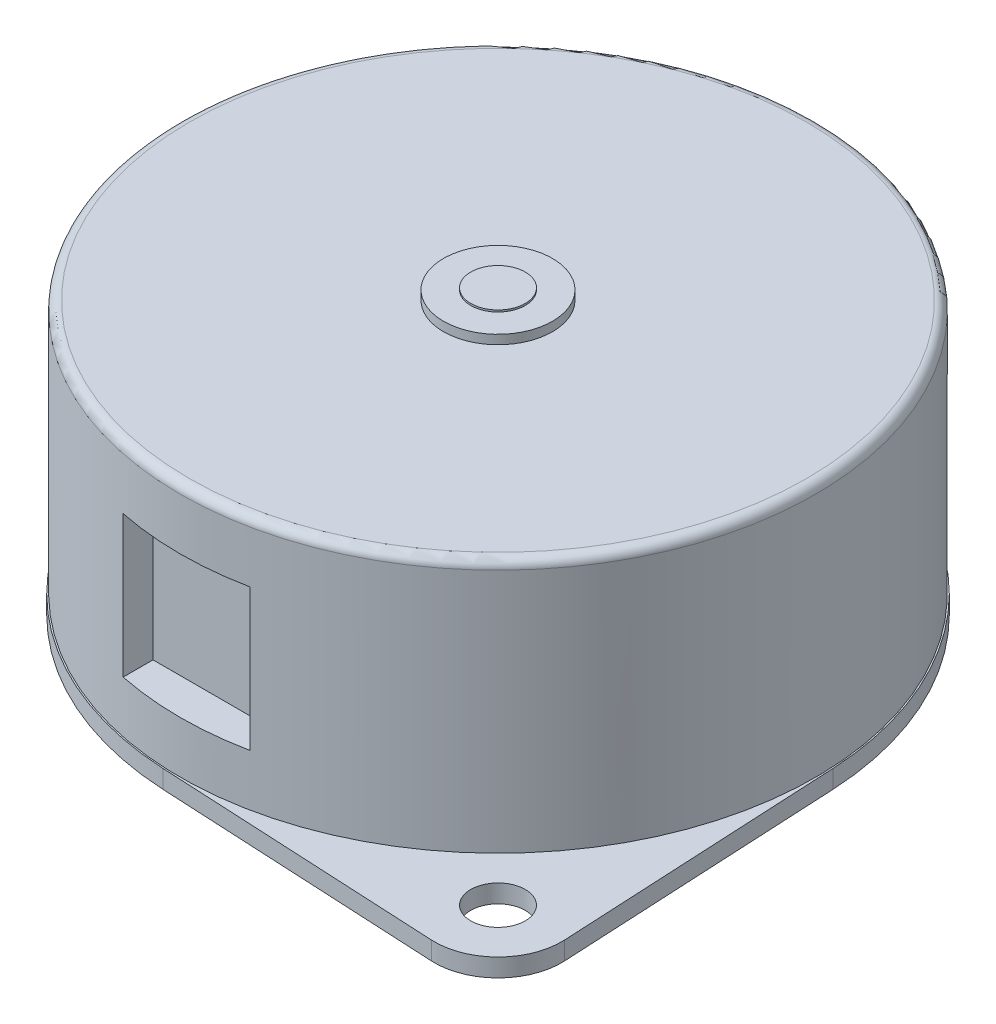
ISO-10303-21;
HEADER;
FILE_DESCRIPTION(('STEP AP214'),'2;1');
FILE_NAME('part.step','',(''),(''),'','','');
FILE_SCHEMA(('AUTOMOTIVE_DESIGN { 1 0 10303 214 1 1 1 1 }'));
ENDSEC;
DATA;
#1=APPLICATION_CONTEXT('core data for automotive mechanical design processes');
#2=APPLICATION_PROTOCOL_DEFINITION('international standard','automotive_design',2000,#1);
#3=PRODUCT_CONTEXT('',#1,'mechanical');
#4=PRODUCT('Part','Part','',(#3));
#5=PRODUCT_RELATED_PRODUCT_CATEGORY('part','',(#4));
#6=PRODUCT_DEFINITION_FORMATION('','',#4);
#7=PRODUCT_DEFINITION_CONTEXT('part definition',#1,'design');
#8=PRODUCT_DEFINITION('design','',#6,#7);
#9=PRODUCT_DEFINITION_SHAPE('','',#8);
#10=(LENGTH_UNIT() NAMED_UNIT(*) SI_UNIT(.MILLI.,.METRE.));
#11=(NAMED_UNIT(*) PLANE_ANGLE_UNIT() SI_UNIT($,.RADIAN.));
#12=(NAMED_UNIT(*) SI_UNIT($,.STERADIAN.) SOLID_ANGLE_UNIT());
#13=UNCERTAINTY_MEASURE_WITH_UNIT(LENGTH_MEASURE(1.E-05),#10,'distance_accuracy_value','');
#14=(GEOMETRIC_REPRESENTATION_CONTEXT(3) GLOBAL_UNCERTAINTY_ASSIGNED_CONTEXT((#13)) GLOBAL_UNIT_ASSIGNED_CONTEXT((#10,
#11,#12)) REPRESENTATION_CONTEXT('',''));
#15=CARTESIAN_POINT('',(0.,0.,0.));
#16=DIRECTION('',(0.,0.,1.));
#17=DIRECTION('',(1.,0.,0.));
#18=AXIS2_PLACEMENT_3D('',#15,#16,#17);
#19=CARTESIAN_POINT('',(0.,14.5,0.));
#20=DIRECTION('',(0.,1.,0.));
#21=DIRECTION('',(0.,0.,1.));
#22=AXIS2_PLACEMENT_3D('',#19,#20,#21);
#23=PLANE('',#22);
#24=CARTESIAN_POINT('',(0.,14.5,0.));
#25=DIRECTION('',(0.,1.,0.));
#26=DIRECTION('',(0.,0.,1.));
#27=AXIS2_PLACEMENT_3D('',#24,#25,#26);
#28=CIRCLE('',#27,3.);
#29=CARTESIAN_POINT('',(0.,14.5,3.));
#30=VERTEX_POINT('',#29);
#31=EDGE_CURVE('E227',#30,#30,#28,.T.);
#32=ORIENTED_EDGE('',*,*,#31,.T.);
#33=EDGE_LOOP('',(#32));
#34=FACE_BOUND('',#33,.T.);
#35=CARTESIAN_POINT('',(0.,14.5,0.));
#36=DIRECTION('',(0.,1.,0.));
#37=DIRECTION('',(0.,0.,1.));
#38=AXIS2_PLACEMENT_3D('',#35,#36,#37);
#39=CIRCLE('',#38,1.5);
#40=CARTESIAN_POINT('',(0.,14.5,1.5));
#41=VERTEX_POINT('',#40);
#42=EDGE_CURVE('E208',#41,#41,#39,.T.);
#43=ORIENTED_EDGE('',*,*,#42,.F.);
#44=EDGE_LOOP('',(#43));
#45=FACE_BOUND('',#44,.T.);
#46=ADVANCED_FACE('F33',(#34,#45),#23,.T.);
#47=CARTESIAN_POINT('',(0.,14.,0.));
#48=DIRECTION('',(0.,1.,0.));
#49=DIRECTION('',(0.,0.,1.));
#50=AXIS2_PLACEMENT_3D('',#47,#48,#49);
#51=PLANE('',#50);
#52=CARTESIAN_POINT('',(0.,14.,0.));
#53=DIRECTION('',(0.,1.,0.));
#54=DIRECTION('',(0.,0.,1.));
#55=AXIS2_PLACEMENT_3D('',#52,#53,#54);
#56=CIRCLE('',#55,17.);
#57=CARTESIAN_POINT('',(0.,14.,17.));
#58=VERTEX_POINT('',#57);
#59=EDGE_CURVE('E177',#58,#58,#56,.T.);
#60=ORIENTED_EDGE('',*,*,#59,.T.);
#61=EDGE_LOOP('',(#60));
#62=FACE_BOUND('',#61,.T.);
#63=CARTESIAN_POINT('',(0.,14.,0.));
#64=DIRECTION('',(0.,1.,0.));
#65=DIRECTION('',(0.,0.,1.));
#66=AXIS2_PLACEMENT_3D('',#63,#64,#65);
#67=CIRCLE('',#66,3.);
#68=CARTESIAN_POINT('',(0.,14.,3.));
#69=VERTEX_POINT('',#68);
#70=EDGE_CURVE('E225',#69,#69,#67,.T.);
#71=ORIENTED_EDGE('',*,*,#70,.F.);
#72=EDGE_LOOP('',(#71));
#73=FACE_BOUND('',#72,.T.);
#74=ADVANCED_FACE('F292',(#62,#73),#51,.T.);
#75=CARTESIAN_POINT('',(0.,-2.5,0.));
#76=DIRECTION('',(0.,-1.,0.));
#77=DIRECTION('',(0.,0.,-1.));
#78=AXIS2_PLACEMENT_3D('',#75,#76,#77);
#79=PLANE('',#78);
#80=CARTESIAN_POINT('',(0.,-2.5,0.));
#81=DIRECTION('',(0.,-1.,0.));
#82=DIRECTION('',(0.,0.,-1.));
#83=AXIS2_PLACEMENT_3D('',#80,#81,#82);
#84=CIRCLE('',#83,5.);
#85=CARTESIAN_POINT('',(0.,-2.5,-5.));
#86=VERTEX_POINT('',#85);
#87=EDGE_CURVE('E239',#86,#86,#84,.T.);
#88=ORIENTED_EDGE('',*,*,#87,.T.);
#89=EDGE_LOOP('',(#88));
#90=FACE_BOUND('',#89,.T.);
#91=CARTESIAN_POINT('',(0.,-2.5,0.));
#92=DIRECTION('',(0.,-1.,0.));
#93=DIRECTION('',(0.,0.,-1.));
#94=AXIS2_PLACEMENT_3D('',#91,#92,#93);
#95=CIRCLE('',#94,1.5);
#96=CARTESIAN_POINT('',(0.,-2.5,-1.5));
#97=VERTEX_POINT('',#96);
#98=EDGE_CURVE('E230',#97,#97,#95,.T.);
#99=ORIENTED_EDGE('',*,*,#98,.F.);
#100=EDGE_LOOP('',(#99));
#101=FACE_BOUND('',#100,.T.);
#102=ADVANCED_FACE('F298',(#90,#101),#79,.T.);
#103=CARTESIAN_POINT('',(14.8492424049174,-1.,14.8492424049176));
#104=DIRECTION('',(0.,-1.,0.));
#105=DIRECTION('',(0.,0.,-1.));
#106=AXIS2_PLACEMENT_3D('',#103,#104,#105);
#107=PLANE('',#106);
#108=CARTESIAN_POINT('',(14.8492424049174,-1.,14.8492424049176));
#109=DIRECTION('',(0.,-1.,0.));
#110=DIRECTION('',(0.,0.,-1.));
#111=AXIS2_PLACEMENT_3D('',#108,#109,#110);
#112=CIRCLE('',#111,1.5);
#113=CARTESIAN_POINT('',(14.8492424049174,-1.,13.3492424049176));
#114=VERTEX_POINT('',#113);
#115=EDGE_CURVE('E245',#114,#114,#112,.T.);
#116=ORIENTED_EDGE('',*,*,#115,.F.);
#117=EDGE_LOOP('',(#116));
#118=FACE_BOUND('',#117,.T.);
#119=CARTESIAN_POINT('',(14.8492424049174,-1.,14.8492424049176));
#120=DIRECTION('',(0.,-1.,0.));
#121=DIRECTION('',(0.,0.,-1.));
#122=AXIS2_PLACEMENT_3D('',#119,#120,#121);
#123=CIRCLE('',#122,3.5);
#124=CARTESIAN_POINT('',(18.3447329760531,-1.,14.6716314055363));
#125=VERTEX_POINT('',#124);
#126=CARTESIAN_POINT('',(14.6716314055361,-1.,18.3447329760533));
#127=VERTEX_POINT('',#126);
#128=EDGE_CURVE('E159',#125,#127,#123,.T.);
#129=ORIENTED_EDGE('',*,*,#128,.T.);
#130=DIRECTION('',(-0.998711591753065,0.,-0.0507459998232365));
#131=VECTOR('',#130,1.);
#132=CARTESIAN_POINT('',(14.6716314055361,-1.,18.3447329760533));
#133=LINE('',#132,#131);
#134=CARTESIAN_POINT('',(-0.89194066206356,-1.,17.5539250672305));
#135=VERTEX_POINT('',#134);
#136=EDGE_CURVE('E99',#127,#135,#133,.T.);
#137=ORIENTED_EDGE('',*,*,#136,.T.);
#138=CARTESIAN_POINT('',(0.,-1.,0.));
#139=DIRECTION('',(0.,-1.,0.));
#140=DIRECTION('',(0.,0.,-1.));
#141=AXIS2_PLACEMENT_3D('',#138,#139,#140);
#142=CIRCLE('',#141,17.5765708660872);
#143=CARTESIAN_POINT('',(-17.5539250672305,-1.,0.891940662063367));
#144=VERTEX_POINT('',#143);
#145=EDGE_CURVE('E257',#135,#144,#142,.T.);
#146=ORIENTED_EDGE('',*,*,#145,.T.);
#147=DIRECTION('',(-0.0507459998232245,0.,-0.998711591753065));
#148=VECTOR('',#147,1.);
#149=CARTESIAN_POINT('',(-18.3447329760531,-1.,-14.6716314055363));
#150=LINE('',#149,#148);
#151=CARTESIAN_POINT('',(-18.3447329760531,-1.,-14.6716314055363));
#152=VERTEX_POINT('',#151);
#153=EDGE_CURVE('E259',#144,#152,#150,.T.);
#154=ORIENTED_EDGE('',*,*,#153,.T.);
#155=CARTESIAN_POINT('',(-14.8492424049174,-1.,-14.8492424049176));
#156=DIRECTION('',(0.,-1.,0.));
#157=DIRECTION('',(0.,0.,-1.));
#158=AXIS2_PLACEMENT_3D('',#155,#156,#157);
#159=CIRCLE('',#158,3.5);
#160=CARTESIAN_POINT('',(-14.6716314055361,-1.,-18.3447329760533));
#161=VERTEX_POINT('',#160);
#162=EDGE_CURVE('E122',#152,#161,#159,.T.);
#163=ORIENTED_EDGE('',*,*,#162,.T.);
#164=DIRECTION('',(0.998711591753065,0.,0.0507459998232365));
#165=VECTOR('',#164,1.);
#166=CARTESIAN_POINT('',(-14.6716314055361,-1.,-18.3447329760533));
#167=LINE('',#166,#165);
#168=CARTESIAN_POINT('',(0.89194066206356,-1.,-17.5539250672305));
#169=VERTEX_POINT('',#168);
#170=EDGE_CURVE('E114',#161,#169,#167,.T.);
#171=ORIENTED_EDGE('',*,*,#170,.T.);
#172=CARTESIAN_POINT('',(0.,-1.,0.));
#173=DIRECTION('',(0.,-1.,0.));
#174=DIRECTION('',(0.,0.,-1.));
#175=AXIS2_PLACEMENT_3D('',#172,#173,#174);
#176=CIRCLE('',#175,17.5765708660872);
#177=CARTESIAN_POINT('',(17.5539250672305,-1.,-0.891940662063361));
#178=VERTEX_POINT('',#177);
#179=EDGE_CURVE('E119',#169,#178,#176,.T.);
#180=ORIENTED_EDGE('',*,*,#179,.T.);
#181=DIRECTION('',(0.0507459998232245,0.,0.998711591753065));
#182=VECTOR('',#181,1.);
#183=CARTESIAN_POINT('',(18.3447329760531,-1.,14.6716314055363));
#184=LINE('',#183,#182);
#185=EDGE_CURVE('E57',#178,#125,#184,.T.);
#186=ORIENTED_EDGE('',*,*,#185,.T.);
#187=EDGE_LOOP('',(#129,#137,#146,#154,#163,#171,#180,#186));
#188=FACE_BOUND('',#187,.T.);
#189=CARTESIAN_POINT('',(-14.8492424049174,-1.,-14.8492424049176));
#190=DIRECTION('',(0.,-1.,0.));
#191=DIRECTION('',(0.,0.,-1.));
#192=AXIS2_PLACEMENT_3D('',#189,#190,#191);
#193=CIRCLE('',#192,1.5);
#194=CARTESIAN_POINT('',(-14.8492424049174,-1.,-16.3492424049176));
#195=VERTEX_POINT('',#194);
#196=EDGE_CURVE('E147',#195,#195,#193,.T.);
#197=ORIENTED_EDGE('',*,*,#196,.F.);
#198=EDGE_LOOP('',(#197));
#199=FACE_BOUND('',#198,.T.);
#200=CARTESIAN_POINT('',(0.,-1.,0.));
#201=DIRECTION('',(0.,-1.,0.));
#202=DIRECTION('',(0.,0.,-1.));
#203=AXIS2_PLACEMENT_3D('',#200,#201,#202);
#204=CIRCLE('',#203,5.);
#205=CARTESIAN_POINT('',(0.,-1.,-5.));
#206=VERTEX_POINT('',#205);
#207=EDGE_CURVE('E236',#206,#206,#204,.T.);
#208=ORIENTED_EDGE('',*,*,#207,.F.);
#209=EDGE_LOOP('',(#208));
#210=FACE_BOUND('',#209,.T.);
#211=ADVANCED_FACE('F116',(#118,#188,#199,#210),#107,.T.);
#212=CARTESIAN_POINT('',(0.,14.,0.));
#213=DIRECTION('',(0.,-1.,0.));
#214=DIRECTION('',(0.,0.,-1.));
#215=AXIS2_PLACEMENT_3D('',#212,#213,#214);
#216=CYLINDRICAL_SURFACE('',#215,17.5);
#217=CARTESIAN_POINT('',(0.,10.65,0.));
#218=DIRECTION('',(0.,1.,0.));
#219=DIRECTION('',(0.,0.,1.));
#220=AXIS2_PLACEMENT_3D('',#217,#218,#219);
#221=CIRCLE('',#220,17.5);
#222=CARTESIAN_POINT('',(-3.5,10.65,17.1464281994823));
#223=VERTEX_POINT('',#222);
#224=CARTESIAN_POINT('',(3.5,10.65,17.1464281994823));
#225=VERTEX_POINT('',#224);
#226=EDGE_CURVE('E186',#223,#225,#221,.T.);
#227=ORIENTED_EDGE('',*,*,#226,.T.);
#228=DIRECTION('',(0.,-1.,0.));
#229=VECTOR('',#228,1.);
#230=CARTESIAN_POINT('',(3.5,14.,17.1464281994823));
#231=LINE('',#230,#229);
#232=CARTESIAN_POINT('',(3.5,2.85,17.1464281994823));
#233=VERTEX_POINT('',#232);
#234=EDGE_CURVE('E11',#225,#233,#231,.T.);
#235=ORIENTED_EDGE('',*,*,#234,.T.);
#236=CARTESIAN_POINT('',(0.,2.85,0.));
#237=DIRECTION('',(0.,-1.,0.));
#238=DIRECTION('',(1.,0.,0.));
#239=AXIS2_PLACEMENT_3D('',#236,#237,#238);
#240=CIRCLE('',#239,17.5);
#241=CARTESIAN_POINT('',(-3.5,2.85,17.1464281994823));
#242=VERTEX_POINT('',#241);
#243=EDGE_CURVE('E183',#233,#242,#240,.T.);
#244=ORIENTED_EDGE('',*,*,#243,.T.);
#245=DIRECTION('',(0.,-1.,0.));
#246=VECTOR('',#245,1.);
#247=CARTESIAN_POINT('',(-3.5,14.,17.1464281994823));
#248=LINE('',#247,#246);
#249=EDGE_CURVE('E41',#242,#223,#248,.F.);
#250=ORIENTED_EDGE('',*,*,#249,.T.);
#251=EDGE_LOOP('',(#227,#235,#244,#250));
#252=FACE_BOUND('',#251,.T.);
#253=CARTESIAN_POINT('',(0.,13.5,0.));
#254=DIRECTION('',(0.,1.,0.));
#255=DIRECTION('',(0.,0.,1.));
#256=AXIS2_PLACEMENT_3D('',#253,#254,#255);
#257=CIRCLE('',#256,17.5);
#258=CARTESIAN_POINT('',(0.,13.5,17.5));
#259=VERTEX_POINT('',#258);
#260=EDGE_CURVE('E180',#259,#259,#257,.F.);
#261=ORIENTED_EDGE('',*,*,#260,.T.);
#262=EDGE_LOOP('',(#261));
#263=FACE_BOUND('',#262,.T.);
#264=CARTESIAN_POINT('',(0.,0.,0.));
#265=DIRECTION('',(0.,-1.,0.));
#266=DIRECTION('',(0.,0.,-1.));
#267=AXIS2_PLACEMENT_3D('',#264,#265,#266);
#268=CIRCLE('',#267,17.5);
#269=CARTESIAN_POINT('',(0.,0.,-17.5));
#270=VERTEX_POINT('',#269);
#271=EDGE_CURVE('E174',#270,#270,#268,.T.);
#272=ORIENTED_EDGE('',*,*,#271,.F.);
#273=EDGE_LOOP('',(#272));
#274=FACE_BOUND('',#273,.T.);
#275=ADVANCED_FACE('F190',(#252,#263,#274),#216,.T.);
#276=CARTESIAN_POINT('',(14.8492424049174,0.,14.8492424049176));
#277=DIRECTION('',(0.,-1.,0.));
#278=DIRECTION('',(0.,0.,-1.));
#279=AXIS2_PLACEMENT_3D('',#276,#277,#278);
#280=PLANE('',#279);
#281=CARTESIAN_POINT('',(14.8492424049174,0.,14.8492424049176));
#282=DIRECTION('',(0.,-1.,0.));
#283=DIRECTION('',(0.,0.,-1.));
#284=AXIS2_PLACEMENT_3D('',#281,#282,#283);
#285=CIRCLE('',#284,1.5);
#286=CARTESIAN_POINT('',(14.8492424049174,0.,13.3492424049176));
#287=VERTEX_POINT('',#286);
#288=EDGE_CURVE('E242',#287,#287,#285,.T.);
#289=ORIENTED_EDGE('',*,*,#288,.T.);
#290=EDGE_LOOP('',(#289));
#291=FACE_BOUND('',#290,.T.);
#292=CARTESIAN_POINT('',(14.8492424049174,0.,14.8492424049176));
#293=DIRECTION('',(0.,-1.,0.));
#294=DIRECTION('',(0.,0.,-1.));
#295=AXIS2_PLACEMENT_3D('',#292,#293,#294);
#296=CIRCLE('',#295,3.5);
#297=CARTESIAN_POINT('',(18.3447329760531,0.,14.6716314055363));
#298=VERTEX_POINT('',#297);
#299=CARTESIAN_POINT('',(14.6716314055361,0.,18.3447329760533));
#300=VERTEX_POINT('',#299);
#301=EDGE_CURVE('E143',#298,#300,#296,.T.);
#302=ORIENTED_EDGE('',*,*,#301,.F.);
#303=DIRECTION('',(0.0507459998232245,0.,0.998711591753065));
#304=VECTOR('',#303,1.);
#305=CARTESIAN_POINT('',(18.3447329760531,0.,14.6716314055363));
#306=LINE('',#305,#304);
#307=CARTESIAN_POINT('',(17.5539250672305,0.,-0.891940662063361));
#308=VERTEX_POINT('',#307);
#309=EDGE_CURVE('E90',#308,#298,#306,.T.);
#310=ORIENTED_EDGE('',*,*,#309,.F.);
#311=CARTESIAN_POINT('',(0.,0.,0.));
#312=DIRECTION('',(0.,-1.,0.));
#313=DIRECTION('',(0.,0.,-1.));
#314=AXIS2_PLACEMENT_3D('',#311,#312,#313);
#315=CIRCLE('',#314,17.5765708660872);
#316=CARTESIAN_POINT('',(0.89194066206356,0.,-17.5539250672305));
#317=VERTEX_POINT('',#316);
#318=EDGE_CURVE('E156',#317,#308,#315,.T.);
#319=ORIENTED_EDGE('',*,*,#318,.F.);
#320=DIRECTION('',(0.998711591753065,0.,0.0507459998232365));
#321=VECTOR('',#320,1.);
#322=CARTESIAN_POINT('',(-14.6716314055361,0.,-18.3447329760533));
#323=LINE('',#322,#321);
#324=CARTESIAN_POINT('',(-14.6716314055361,0.,-18.3447329760533));
#325=VERTEX_POINT('',#324);
#326=EDGE_CURVE('E131',#325,#317,#323,.T.);
#327=ORIENTED_EDGE('',*,*,#326,.F.);
#328=CARTESIAN_POINT('',(-14.8492424049174,0.,-14.8492424049176));
#329=DIRECTION('',(0.,-1.,0.));
#330=DIRECTION('',(0.,0.,-1.));
#331=AXIS2_PLACEMENT_3D('',#328,#329,#330);
#332=CIRCLE('',#331,3.5);
#333=CARTESIAN_POINT('',(-18.3447329760531,0.,-14.6716314055363));
#334=VERTEX_POINT('',#333);
#335=EDGE_CURVE('E153',#334,#325,#332,.T.);
#336=ORIENTED_EDGE('',*,*,#335,.F.);
#337=DIRECTION('',(-0.0507459998232245,0.,-0.998711591753065));
#338=VECTOR('',#337,1.);
#339=CARTESIAN_POINT('',(-18.3447329760531,0.,-14.6716314055363));
#340=LINE('',#339,#338);
#341=CARTESIAN_POINT('',(-17.5539250672305,0.,0.891940662063367));
#342=VERTEX_POINT('',#341);
#343=EDGE_CURVE('E151',#342,#334,#340,.T.);
#344=ORIENTED_EDGE('',*,*,#343,.F.);
#345=CARTESIAN_POINT('',(0.,0.,0.));
#346=DIRECTION('',(0.,-1.,0.));
#347=DIRECTION('',(0.,0.,-1.));
#348=AXIS2_PLACEMENT_3D('',#345,#346,#347);
#349=CIRCLE('',#348,17.5765708660872);
#350=CARTESIAN_POINT('',(-0.89194066206356,0.,17.5539250672305));
#351=VERTEX_POINT('',#350);
#352=EDGE_CURVE('E149',#351,#342,#349,.T.);
#353=ORIENTED_EDGE('',*,*,#352,.F.);
#354=DIRECTION('',(-0.998711591753065,0.,-0.0507459998232365));
#355=VECTOR('',#354,1.);
#356=CARTESIAN_POINT('',(14.6716314055361,0.,18.3447329760533));
#357=LINE('',#356,#355);
#358=EDGE_CURVE('E146',#300,#351,#357,.T.);
#359=ORIENTED_EDGE('',*,*,#358,.F.);
#360=EDGE_LOOP('',(#302,#310,#319,#327,#336,#344,#353,#359));
#361=FACE_BOUND('',#360,.T.);
#362=CARTESIAN_POINT('',(-14.8492424049174,0.,-14.8492424049176));
#363=DIRECTION('',(0.,-1.,0.));
#364=DIRECTION('',(0.,0.,-1.));
#365=AXIS2_PLACEMENT_3D('',#362,#363,#364);
#366=CIRCLE('',#365,1.5);
#367=CARTESIAN_POINT('',(-14.8492424049174,0.,-16.3492424049176));
#368=VERTEX_POINT('',#367);
#369=EDGE_CURVE('E248',#368,#368,#366,.T.);
#370=ORIENTED_EDGE('',*,*,#369,.T.);
#371=EDGE_LOOP('',(#370));
#372=FACE_BOUND('',#371,.T.);
#373=ORIENTED_EDGE('',*,*,#271,.T.);
#374=EDGE_LOOP('',(#373));
#375=FACE_BOUND('',#374,.T.);
#376=ADVANCED_FACE('F272',(#291,#361,#372,#375),#280,.F.);
#377=CARTESIAN_POINT('',(14.8492424049174,-1.,14.8492424049176));
#378=DIRECTION('',(0.,1.,0.));
#379=DIRECTION('',(0.,0.,1.));
#380=AXIS2_PLACEMENT_3D('',#377,#378,#379);
#381=CYLINDRICAL_SURFACE('',#380,3.5);
#382=ORIENTED_EDGE('',*,*,#301,.T.);
#383=DIRECTION('',(0.,1.,0.));
#384=VECTOR('',#383,1.);
#385=CARTESIAN_POINT('',(14.6716314055361,-1.,18.3447329760533));
#386=LINE('',#385,#384);
#387=EDGE_CURVE('E172',#127,#300,#386,.T.);
#388=ORIENTED_EDGE('',*,*,#387,.F.);
#389=ORIENTED_EDGE('',*,*,#128,.F.);
#390=DIRECTION('',(0.,1.,0.));
#391=VECTOR('',#390,1.);
#392=CARTESIAN_POINT('',(18.3447329760531,-1.,14.6716314055363));
#393=LINE('',#392,#391);
#394=EDGE_CURVE('E139',#125,#298,#393,.T.);
#395=ORIENTED_EDGE('',*,*,#394,.T.);
#396=EDGE_LOOP('',(#382,#388,#389,#395));
#397=FACE_BOUND('',#396,.T.);
#398=ADVANCED_FACE('F278',(#397),#381,.T.);
#399=CARTESIAN_POINT('',(14.6716314055361,-1.,18.3447329760533));
#400=DIRECTION('',(0.0507459998232365,0.,-0.998711591753065));
#401=DIRECTION('',(-0.998711591753065,0.,-0.0507459998232365));
#402=AXIS2_PLACEMENT_3D('',#399,#400,#401);
#403=PLANE('',#402);
#404=ORIENTED_EDGE('',*,*,#358,.T.);
#405=DIRECTION('',(0.,1.,0.));
#406=VECTOR('',#405,1.);
#407=CARTESIAN_POINT('',(-0.89194066206356,-1.,17.5539250672305));
#408=LINE('',#407,#406);
#409=EDGE_CURVE('E169',#135,#351,#408,.T.);
#410=ORIENTED_EDGE('',*,*,#409,.F.);
#411=ORIENTED_EDGE('',*,*,#136,.F.);
#412=ORIENTED_EDGE('',*,*,#387,.T.);
#413=EDGE_LOOP('',(#404,#410,#411,#412));
#414=FACE_BOUND('',#413,.T.);
#415=ADVANCED_FACE('F279',(#414),#403,.F.);
#416=CARTESIAN_POINT('',(0.,-1.,0.));
#417=DIRECTION('',(0.,1.,0.));
#418=DIRECTION('',(0.,0.,1.));
#419=AXIS2_PLACEMENT_3D('',#416,#417,#418);
#420=CYLINDRICAL_SURFACE('',#419,17.5765708660872);
#421=ORIENTED_EDGE('',*,*,#352,.T.);
#422=DIRECTION('',(0.,1.,0.));
#423=VECTOR('',#422,1.);
#424=CARTESIAN_POINT('',(-17.5539250672305,-1.,0.891940662063367));
#425=LINE('',#424,#423);
#426=EDGE_CURVE('E166',#144,#342,#425,.T.);
#427=ORIENTED_EDGE('',*,*,#426,.F.);
#428=ORIENTED_EDGE('',*,*,#145,.F.);
#429=ORIENTED_EDGE('',*,*,#409,.T.);
#430=EDGE_LOOP('',(#421,#427,#428,#429));
#431=FACE_BOUND('',#430,.T.);
#432=ADVANCED_FACE('F282',(#431),#420,.T.);
#433=CARTESIAN_POINT('',(-18.3447329760531,-1.,-14.6716314055363));
#434=DIRECTION('',(0.998711591753065,0.,-0.0507459998232245));
#435=DIRECTION('',(-0.0507459998232245,0.,-0.998711591753065));
#436=AXIS2_PLACEMENT_3D('',#433,#434,#435);
#437=PLANE('',#436);
#438=ORIENTED_EDGE('',*,*,#343,.T.);
#439=DIRECTION('',(0.,1.,0.));
#440=VECTOR('',#439,1.);
#441=CARTESIAN_POINT('',(-18.3447329760531,-1.,-14.6716314055363));
#442=LINE('',#441,#440);
#443=EDGE_CURVE('E163',#152,#334,#442,.T.);
#444=ORIENTED_EDGE('',*,*,#443,.F.);
#445=ORIENTED_EDGE('',*,*,#153,.F.);
#446=ORIENTED_EDGE('',*,*,#426,.T.);
#447=EDGE_LOOP('',(#438,#444,#445,#446));
#448=FACE_BOUND('',#447,.T.);
#449=ADVANCED_FACE('F265',(#448),#437,.F.);
#450=CARTESIAN_POINT('',(-14.8492424049174,-1.,-14.8492424049176));
#451=DIRECTION('',(0.,1.,0.));
#452=DIRECTION('',(0.,0.,1.));
#453=AXIS2_PLACEMENT_3D('',#450,#451,#452);
#454=CYLINDRICAL_SURFACE('',#453,3.5);
#455=ORIENTED_EDGE('',*,*,#335,.T.);
#456=DIRECTION('',(0.,1.,0.));
#457=VECTOR('',#456,1.);
#458=CARTESIAN_POINT('',(-14.6716314055361,-1.,-18.3447329760533));
#459=LINE('',#458,#457);
#460=EDGE_CURVE('E134',#161,#325,#459,.T.);
#461=ORIENTED_EDGE('',*,*,#460,.F.);
#462=ORIENTED_EDGE('',*,*,#162,.F.);
#463=ORIENTED_EDGE('',*,*,#443,.T.);
#464=EDGE_LOOP('',(#455,#461,#462,#463));
#465=FACE_BOUND('',#464,.T.);
#466=ADVANCED_FACE('F269',(#465),#454,.T.);
#467=CARTESIAN_POINT('',(-14.6716314055361,-1.,-18.3447329760533));
#468=DIRECTION('',(-0.0507459998232365,0.,0.998711591753065));
#469=DIRECTION('',(0.998711591753065,0.,0.0507459998232365));
#470=AXIS2_PLACEMENT_3D('',#467,#468,#469);
#471=PLANE('',#470);
#472=ORIENTED_EDGE('',*,*,#326,.T.);
#473=DIRECTION('',(0.,1.,0.));
#474=VECTOR('',#473,1.);
#475=CARTESIAN_POINT('',(0.89194066206356,-1.,-17.5539250672305));
#476=LINE('',#475,#474);
#477=EDGE_CURVE('E128',#169,#317,#476,.T.);
#478=ORIENTED_EDGE('',*,*,#477,.F.);
#479=ORIENTED_EDGE('',*,*,#170,.F.);
#480=ORIENTED_EDGE('',*,*,#460,.T.);
#481=EDGE_LOOP('',(#472,#478,#479,#480));
#482=FACE_BOUND('',#481,.T.);
#483=ADVANCED_FACE('F129',(#482),#471,.F.);
#484=CARTESIAN_POINT('',(0.,-1.,0.));
#485=DIRECTION('',(0.,1.,0.));
#486=DIRECTION('',(0.,0.,1.));
#487=AXIS2_PLACEMENT_3D('',#484,#485,#486);
#488=CYLINDRICAL_SURFACE('',#487,17.5765708660872);
#489=ORIENTED_EDGE('',*,*,#318,.T.);
#490=DIRECTION('',(0.,1.,0.));
#491=VECTOR('',#490,1.);
#492=CARTESIAN_POINT('',(17.5539250672305,-1.,-0.891940662063361));
#493=LINE('',#492,#491);
#494=EDGE_CURVE('E135',#178,#308,#493,.T.);
#495=ORIENTED_EDGE('',*,*,#494,.F.);
#496=ORIENTED_EDGE('',*,*,#179,.F.);
#497=ORIENTED_EDGE('',*,*,#477,.T.);
#498=EDGE_LOOP('',(#489,#495,#496,#497));
#499=FACE_BOUND('',#498,.T.);
#500=ADVANCED_FACE('F137',(#499),#488,.T.);
#501=CARTESIAN_POINT('',(18.3447329760531,-1.,14.6716314055363));
#502=DIRECTION('',(-0.998711591753065,0.,0.0507459998232245));
#503=DIRECTION('',(0.0507459998232245,0.,0.998711591753065));
#504=AXIS2_PLACEMENT_3D('',#501,#502,#503);
#505=PLANE('',#504);
#506=ORIENTED_EDGE('',*,*,#309,.T.);
#507=ORIENTED_EDGE('',*,*,#394,.F.);
#508=ORIENTED_EDGE('',*,*,#185,.F.);
#509=ORIENTED_EDGE('',*,*,#494,.T.);
#510=EDGE_LOOP('',(#506,#507,#508,#509));
#511=FACE_BOUND('',#510,.T.);
#512=ADVANCED_FACE('F274',(#511),#505,.F.);
#513=CARTESIAN_POINT('',(-14.8492424049174,-1.,-14.8492424049176));
#514=DIRECTION('',(0.,1.,0.));
#515=DIRECTION('',(0.,0.,1.));
#516=AXIS2_PLACEMENT_3D('',#513,#514,#515);
#517=CYLINDRICAL_SURFACE('',#516,1.5);
#518=ORIENTED_EDGE('',*,*,#196,.T.);
#519=EDGE_LOOP('',(#518));
#520=FACE_BOUND('',#519,.T.);
#521=ORIENTED_EDGE('',*,*,#369,.F.);
#522=EDGE_LOOP('',(#521));
#523=FACE_BOUND('',#522,.T.);
#524=ADVANCED_FACE('F328',(#520,#523),#517,.F.);
#525=CARTESIAN_POINT('',(14.8492424049174,-1.,14.8492424049176));
#526=DIRECTION('',(0.,1.,0.));
#527=DIRECTION('',(0.,0.,1.));
#528=AXIS2_PLACEMENT_3D('',#525,#526,#527);
#529=CYLINDRICAL_SURFACE('',#528,1.5);
#530=ORIENTED_EDGE('',*,*,#115,.T.);
#531=EDGE_LOOP('',(#530));
#532=FACE_BOUND('',#531,.T.);
#533=ORIENTED_EDGE('',*,*,#288,.F.);
#534=EDGE_LOOP('',(#533));
#535=FACE_BOUND('',#534,.T.);
#536=ADVANCED_FACE('F324',(#532,#535),#529,.F.);
#537=CARTESIAN_POINT('',(0.,-2.5,0.));
#538=DIRECTION('',(0.,1.,0.));
#539=DIRECTION('',(0.,0.,1.));
#540=AXIS2_PLACEMENT_3D('',#537,#538,#539);
#541=CYLINDRICAL_SURFACE('',#540,5.);
#542=ORIENTED_EDGE('',*,*,#87,.F.);
#543=EDGE_LOOP('',(#542));
#544=FACE_BOUND('',#543,.T.);
#545=ORIENTED_EDGE('',*,*,#207,.T.);
#546=EDGE_LOOP('',(#545));
#547=FACE_BOUND('',#546,.T.);
#548=ADVANCED_FACE('F317',(#544,#547),#541,.T.);
#549=CARTESIAN_POINT('',(0.,-13.5,0.));
#550=DIRECTION('',(0.,1.,0.));
#551=DIRECTION('',(0.,0.,1.));
#552=AXIS2_PLACEMENT_3D('',#549,#550,#551);
#553=CYLINDRICAL_SURFACE('',#552,1.5);
#554=CARTESIAN_POINT('',(0.,-13.5,0.));
#555=DIRECTION('',(0.,-1.,0.));
#556=DIRECTION('',(0.,0.,-1.));
#557=AXIS2_PLACEMENT_3D('',#554,#555,#556);
#558=CIRCLE('',#557,1.5);
#559=CARTESIAN_POINT('',(0.,-13.5,-1.5));
#560=VERTEX_POINT('',#559);
#561=EDGE_CURVE('E233',#560,#560,#558,.T.);
#562=ORIENTED_EDGE('',*,*,#561,.F.);
#563=EDGE_LOOP('',(#562));
#564=FACE_BOUND('',#563,.T.);
#565=ORIENTED_EDGE('',*,*,#98,.T.);
#566=EDGE_LOOP('',(#565));
#567=FACE_BOUND('',#566,.T.);
#568=ADVANCED_FACE('F313',(#564,#567),#553,.T.);
#569=CARTESIAN_POINT('',(0.,-13.5,0.));
#570=DIRECTION('',(0.,-1.,0.));
#571=DIRECTION('',(0.,0.,-1.));
#572=AXIS2_PLACEMENT_3D('',#569,#570,#571);
#573=PLANE('',#572);
#574=ORIENTED_EDGE('',*,*,#561,.T.);
#575=EDGE_LOOP('',(#574));
#576=FACE_BOUND('',#575,.T.);
#577=ADVANCED_FACE('F309',(#576),#573,.T.);
#578=CARTESIAN_POINT('',(0.,14.5,0.));
#579=DIRECTION('',(0.,-1.,0.));
#580=DIRECTION('',(0.,0.,-1.));
#581=AXIS2_PLACEMENT_3D('',#578,#579,#580);
#582=CYLINDRICAL_SURFACE('',#581,3.);
#583=ORIENTED_EDGE('',*,*,#31,.F.);
#584=EDGE_LOOP('',(#583));
#585=FACE_BOUND('',#584,.T.);
#586=ORIENTED_EDGE('',*,*,#70,.T.);
#587=EDGE_LOOP('',(#586));
#588=FACE_BOUND('',#587,.T.);
#589=ADVANCED_FACE('F306',(#585,#588),#582,.T.);
#590=CARTESIAN_POINT('',(0.,14.6,0.));
#591=DIRECTION('',(0.,-1.,0.));
#592=DIRECTION('',(0.,0.,-1.));
#593=AXIS2_PLACEMENT_3D('',#590,#591,#592);
#594=CYLINDRICAL_SURFACE('',#593,1.5);
#595=CARTESIAN_POINT('',(0.,14.6,0.));
#596=DIRECTION('',(0.,1.,0.));
#597=DIRECTION('',(0.,0.,1.));
#598=AXIS2_PLACEMENT_3D('',#595,#596,#597);
#599=CIRCLE('',#598,1.5);
#600=CARTESIAN_POINT('',(0.,14.6,1.5));
#601=VERTEX_POINT('',#600);
#602=EDGE_CURVE('E212',#601,#601,#599,.T.);
#603=ORIENTED_EDGE('',*,*,#602,.F.);
#604=EDGE_LOOP('',(#603));
#605=FACE_BOUND('',#604,.T.);
#606=ORIENTED_EDGE('',*,*,#42,.T.);
#607=EDGE_LOOP('',(#606));
#608=FACE_BOUND('',#607,.T.);
#609=ADVANCED_FACE('F304',(#605,#608),#594,.T.);
#610=CARTESIAN_POINT('',(0.,14.6,0.));
#611=DIRECTION('',(0.,1.,0.));
#612=DIRECTION('',(0.,0.,1.));
#613=AXIS2_PLACEMENT_3D('',#610,#611,#612);
#614=PLANE('',#613);
#615=ORIENTED_EDGE('',*,*,#602,.T.);
#616=EDGE_LOOP('',(#615));
#617=FACE_BOUND('',#616,.T.);
#618=ADVANCED_FACE('F394',(#617),#614,.T.);
#619=CARTESIAN_POINT('',(0.,13.5,0.));
#620=DIRECTION('',(0.,1.,0.));
#621=DIRECTION('',(0.,0.,1.));
#622=AXIS2_PLACEMENT_3D('',#619,#620,#621);
#623=TOROIDAL_SURFACE('',#622,17.,0.5);
#624=ORIENTED_EDGE('',*,*,#260,.F.);
#625=EDGE_LOOP('',(#624));
#626=FACE_BOUND('',#625,.T.);
#627=ORIENTED_EDGE('',*,*,#59,.F.);
#628=EDGE_LOOP('',(#627));
#629=FACE_BOUND('',#628,.T.);
#630=ADVANCED_FACE('F35',(#626,#629),#623,.T.);
#631=CARTESIAN_POINT('',(-3.5,10.65,15.5));
#632=DIRECTION('',(-1.,0.,0.));
#633=DIRECTION('',(0.,-1.,0.));
#634=AXIS2_PLACEMENT_3D('',#631,#632,#633);
#635=PLANE('',#634);
#636=DIRECTION('',(0.,0.,1.));
#637=VECTOR('',#636,1.);
#638=CARTESIAN_POINT('',(-3.5,2.85,15.5));
#639=LINE('',#638,#637);
#640=CARTESIAN_POINT('',(-3.5,2.85,15.5));
#641=VERTEX_POINT('',#640);
#642=EDGE_CURVE('E48',#641,#242,#639,.T.);
#643=ORIENTED_EDGE('',*,*,#642,.F.);
#644=DIRECTION('',(0.,-1.,0.));
#645=VECTOR('',#644,1.);
#646=CARTESIAN_POINT('',(-3.5,10.65,15.5));
#647=LINE('',#646,#645);
#648=CARTESIAN_POINT('',(-3.5,10.65,15.5));
#649=VERTEX_POINT('',#648);
#650=EDGE_CURVE('E204',#649,#641,#647,.T.);
#651=ORIENTED_EDGE('',*,*,#650,.F.);
#652=DIRECTION('',(0.,0.,1.));
#653=VECTOR('',#652,1.);
#654=CARTESIAN_POINT('',(-3.5,10.65,15.5));
#655=LINE('',#654,#653);
#656=EDGE_CURVE('E201',#649,#223,#655,.T.);
#657=ORIENTED_EDGE('',*,*,#656,.T.);
#658=ORIENTED_EDGE('',*,*,#249,.F.);
#659=EDGE_LOOP('',(#643,#651,#657,#658));
#660=FACE_BOUND('',#659,.T.);
#661=ADVANCED_FACE('F197',(#660),#635,.F.);
#662=CARTESIAN_POINT('',(-3.5,10.65,15.5));
#663=DIRECTION('',(0.,1.,0.));
#664=DIRECTION('',(0.,0.,1.));
#665=AXIS2_PLACEMENT_3D('',#662,#663,#664);
#666=PLANE('',#665);
#667=ORIENTED_EDGE('',*,*,#226,.F.);
#668=ORIENTED_EDGE('',*,*,#656,.F.);
#669=DIRECTION('',(-1.,0.,0.));
#670=VECTOR('',#669,1.);
#671=CARTESIAN_POINT('',(-3.5,10.65,15.5));
#672=LINE('',#671,#670);
#673=CARTESIAN_POINT('',(3.5,10.65,15.5));
#674=VERTEX_POINT('',#673);
#675=EDGE_CURVE('E218',#674,#649,#672,.T.);
#676=ORIENTED_EDGE('',*,*,#675,.F.);
#677=DIRECTION('',(0.,0.,1.));
#678=VECTOR('',#677,1.);
#679=CARTESIAN_POINT('',(3.5,10.65,15.5));
#680=LINE('',#679,#678);
#681=EDGE_CURVE('E209',#674,#225,#680,.T.);
#682=ORIENTED_EDGE('',*,*,#681,.T.);
#683=EDGE_LOOP('',(#667,#668,#676,#682));
#684=FACE_BOUND('',#683,.T.);
#685=ADVANCED_FACE('F415',(#684),#666,.F.);
#686=CARTESIAN_POINT('',(3.5,10.65,15.5));
#687=DIRECTION('',(1.,0.,0.));
#688=DIRECTION('',(0.,1.,0.));
#689=AXIS2_PLACEMENT_3D('',#686,#687,#688);
#690=PLANE('',#689);
#691=ORIENTED_EDGE('',*,*,#681,.F.);
#692=DIRECTION('',(0.,1.,0.));
#693=VECTOR('',#692,1.);
#694=CARTESIAN_POINT('',(3.5,10.65,15.5));
#695=LINE('',#694,#693);
#696=CARTESIAN_POINT('',(3.5,2.85,15.5));
#697=VERTEX_POINT('',#696);
#698=EDGE_CURVE('E542',#697,#674,#695,.T.);
#699=ORIENTED_EDGE('',*,*,#698,.F.);
#700=DIRECTION('',(0.,0.,1.));
#701=VECTOR('',#700,1.);
#702=CARTESIAN_POINT('',(3.5,2.85,15.5));
#703=LINE('',#702,#701);
#704=EDGE_CURVE('E215',#697,#233,#703,.T.);
#705=ORIENTED_EDGE('',*,*,#704,.T.);
#706=ORIENTED_EDGE('',*,*,#234,.F.);
#707=EDGE_LOOP('',(#691,#699,#705,#706));
#708=FACE_BOUND('',#707,.T.);
#709=ADVANCED_FACE('F422',(#708),#690,.F.);
#710=CARTESIAN_POINT('',(-3.5,2.85,15.5));
#711=DIRECTION('',(0.,-1.,0.));
#712=DIRECTION('',(1.,0.,0.));
#713=AXIS2_PLACEMENT_3D('',#710,#711,#712);
#714=PLANE('',#713);
#715=ORIENTED_EDGE('',*,*,#704,.F.);
#716=DIRECTION('',(1.,0.,0.));
#717=VECTOR('',#716,1.);
#718=CARTESIAN_POINT('',(-3.5,2.85,15.5));
#719=LINE('',#718,#717);
#720=EDGE_CURVE('E539',#641,#697,#719,.T.);
#721=ORIENTED_EDGE('',*,*,#720,.F.);
#722=ORIENTED_EDGE('',*,*,#642,.T.);
#723=ORIENTED_EDGE('',*,*,#243,.F.);
#724=EDGE_LOOP('',(#715,#721,#722,#723));
#725=FACE_BOUND('',#724,.T.);
#726=ADVANCED_FACE('F429',(#725),#714,.F.);
#727=CARTESIAN_POINT('',(0.,0.,15.5));
#728=DIRECTION('',(0.,0.,1.));
#729=DIRECTION('',(1.,0.,0.));
#730=AXIS2_PLACEMENT_3D('',#727,#728,#729);
#731=PLANE('',#730);
#732=ORIENTED_EDGE('',*,*,#650,.T.);
#733=ORIENTED_EDGE('',*,*,#720,.T.);
#734=ORIENTED_EDGE('',*,*,#698,.T.);
#735=ORIENTED_EDGE('',*,*,#675,.T.);
#736=EDGE_LOOP('',(#732,#733,#734,#735));
#737=FACE_BOUND('',#736,.T.);
#738=ADVANCED_FACE('F437',(#737),#731,.T.);
#739=CLOSED_SHELL('',(#46,#74,#102,#211,#275,#376,#398,#415,#432,#449,#466,#483,#500,#512,#524,
#536,#548,#568,#577,#589,#609,#618,#630,#661,#685,#709,#726,#738));
#740=MANIFOLD_SOLID_BREP('B2',#739);
#741=ADVANCED_BREP_SHAPE_REPRESENTATION('',(#18,#740),#14);
#742=SHAPE_DEFINITION_REPRESENTATION(#9,#741);
ENDSEC;
END-ISO-10303-21;
